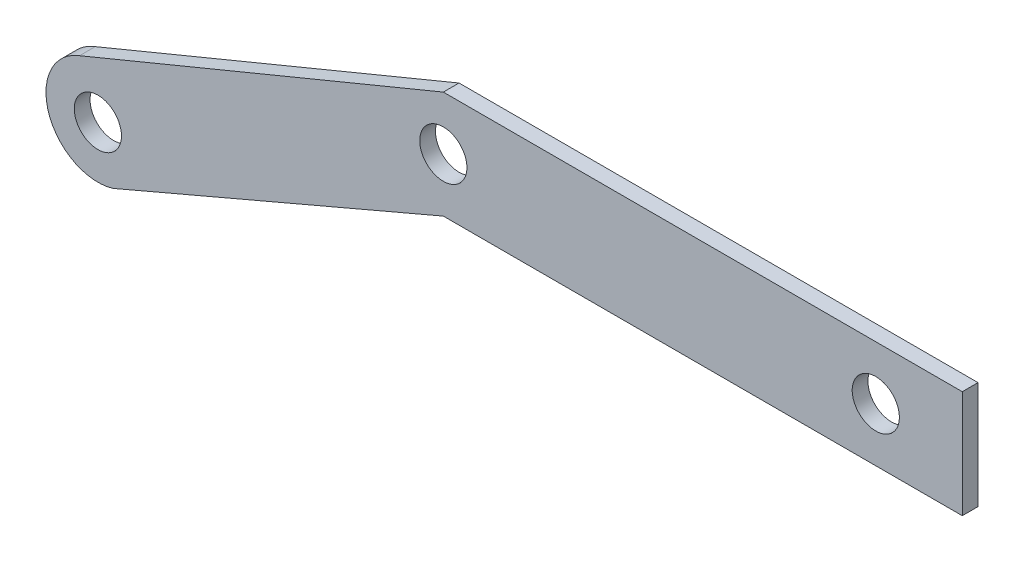
ISO-10303-21;
HEADER;
FILE_DESCRIPTION(('STEP AP214'),'2;1');
FILE_NAME('part.step','',(''),(''),'','','');
FILE_SCHEMA(('AUTOMOTIVE_DESIGN { 1 0 10303 214 1 1 1 1 }'));
ENDSEC;
DATA;
#1=APPLICATION_CONTEXT('core data for automotive mechanical design processes');
#2=APPLICATION_PROTOCOL_DEFINITION('international standard','automotive_design',2000,#1);
#3=PRODUCT_CONTEXT('',#1,'mechanical');
#4=PRODUCT('Part','Part','',(#3));
#5=PRODUCT_RELATED_PRODUCT_CATEGORY('part','',(#4));
#6=PRODUCT_DEFINITION_FORMATION('','',#4);
#7=PRODUCT_DEFINITION_CONTEXT('part definition',#1,'design');
#8=PRODUCT_DEFINITION('design','',#6,#7);
#9=PRODUCT_DEFINITION_SHAPE('','',#8);
#10=(LENGTH_UNIT() NAMED_UNIT(*) SI_UNIT(.MILLI.,.METRE.));
#11=(NAMED_UNIT(*) PLANE_ANGLE_UNIT() SI_UNIT($,.RADIAN.));
#12=(NAMED_UNIT(*) SI_UNIT($,.STERADIAN.) SOLID_ANGLE_UNIT());
#13=UNCERTAINTY_MEASURE_WITH_UNIT(LENGTH_MEASURE(1.E-05),#10,'distance_accuracy_value','');
#14=(GEOMETRIC_REPRESENTATION_CONTEXT(3) GLOBAL_UNCERTAINTY_ASSIGNED_CONTEXT((#13)) GLOBAL_UNIT_ASSIGNED_CONTEXT((#10,
#11,#12)) REPRESENTATION_CONTEXT('',''));
#15=CARTESIAN_POINT('',(0.,0.,0.));
#16=DIRECTION('',(0.,0.,1.));
#17=DIRECTION('',(1.,0.,0.));
#18=AXIS2_PLACEMENT_3D('',#15,#16,#17);
#19=CARTESIAN_POINT('',(-15.705782080516,12.9503608385512,1.));
#20=DIRECTION('',(0.,0.,1.));
#21=DIRECTION('',(1.,0.,0.));
#22=AXIS2_PLACEMENT_3D('',#19,#20,#21);
#23=PLANE('',#22);
#24=CARTESIAN_POINT('',(6.26121791948399,22.1848608385512,1.));
#25=DIRECTION('',(0.,0.,1.));
#26=DIRECTION('',(1.,0.,0.));
#27=AXIS2_PLACEMENT_3D('',#24,#25,#26);
#28=CIRCLE('',#27,1.5);
#29=CARTESIAN_POINT('',(7.76121791948399,22.1848608385512,1.));
#30=VERTEX_POINT('',#29);
#31=EDGE_CURVE('E185',#30,#30,#28,.T.);
#32=ORIENTED_EDGE('',*,*,#31,.F.);
#33=EDGE_LOOP('',(#32));
#34=FACE_BOUND('',#33,.T.);
#35=DIRECTION('',(0.,1.,0.));
#36=VECTOR('',#35,1.);
#37=CARTESIAN_POINT('',(39.261217919484,25.6003608385512,1.));
#38=LINE('',#37,#36);
#39=CARTESIAN_POINT('',(39.261217919484,18.7693608385514,1.));
#40=VERTEX_POINT('',#39);
#41=CARTESIAN_POINT('',(39.261217919484,25.6003608385512,1.));
#42=VERTEX_POINT('',#41);
#43=EDGE_CURVE('E130',#40,#42,#38,.T.);
#44=ORIENTED_EDGE('',*,*,#43,.T.);
#45=DIRECTION('',(-1.,0.,0.));
#46=VECTOR('',#45,1.);
#47=CARTESIAN_POINT('',(6.26121791948399,25.6003608385513,1.));
#48=LINE('',#47,#46);
#49=CARTESIAN_POINT('',(6.26121791948399,25.6003608385513,1.));
#50=VERTEX_POINT('',#49);
#51=EDGE_CURVE('E88',#42,#50,#48,.T.);
#52=ORIENTED_EDGE('',*,*,#51,.T.);
#53=DIRECTION('',(-0.924149912006193,-0.382030025179888,0.));
#54=VECTOR('',#53,1.);
#55=CARTESIAN_POINT('',(-16.8722094768274,16.0373410991188,1.));
#56=LINE('',#55,#54);
#57=CARTESIAN_POINT('',(-16.8722094768274,16.0373410991188,1.));
#58=VERTEX_POINT('',#57);
#59=EDGE_CURVE('E101',#50,#58,#56,.T.);
#60=ORIENTED_EDGE('',*,*,#59,.T.);
#61=CARTESIAN_POINT('',(-15.705782080516,12.9503608385512,1.));
#62=DIRECTION('',(0.,0.,1.));
#63=DIRECTION('',(1.,0.,0.));
#64=AXIS2_PLACEMENT_3D('',#61,#62,#63);
#65=CIRCLE('',#64,3.29999999999999);
#66=CARTESIAN_POINT('',(-14.7395138788082,9.79499623800688,1.));
#67=VERTEX_POINT('',#66);
#68=EDGE_CURVE('E95',#58,#67,#65,.T.);
#69=ORIENTED_EDGE('',*,*,#68,.T.);
#70=DIRECTION('',(0.919555921015902,0.392959168520847,0.));
#71=VECTOR('',#70,1.);
#72=CARTESIAN_POINT('',(6.26121791948399,18.7693608385514,1.));
#73=LINE('',#72,#71);
#74=CARTESIAN_POINT('',(6.26121791948399,18.7693608385514,1.));
#75=VERTEX_POINT('',#74);
#76=EDGE_CURVE('E99',#67,#75,#73,.T.);
#77=ORIENTED_EDGE('',*,*,#76,.T.);
#78=DIRECTION('',(1.,0.,0.));
#79=VECTOR('',#78,1.);
#80=CARTESIAN_POINT('',(6.26121791948399,18.7693608385514,1.));
#81=LINE('',#80,#79);
#82=EDGE_CURVE('E51',#75,#40,#81,.T.);
#83=ORIENTED_EDGE('',*,*,#82,.T.);
#84=EDGE_LOOP('',(#44,#52,#60,#69,#77,#83));
#85=FACE_BOUND('',#84,.T.);
#86=CARTESIAN_POINT('',(33.7612179194839,22.1848608385512,1.));
#87=DIRECTION('',(0.,0.,1.));
#88=DIRECTION('',(1.,0.,0.));
#89=AXIS2_PLACEMENT_3D('',#86,#87,#88);
#90=CIRCLE('',#89,1.5);
#91=CARTESIAN_POINT('',(35.261217919484,22.1848608385512,1.));
#92=VERTEX_POINT('',#91);
#93=EDGE_CURVE('E123',#92,#92,#90,.T.);
#94=ORIENTED_EDGE('',*,*,#93,.F.);
#95=EDGE_LOOP('',(#94));
#96=FACE_BOUND('',#95,.T.);
#97=CARTESIAN_POINT('',(-15.705782080516,12.9503608385512,1.));
#98=DIRECTION('',(0.,0.,1.));
#99=DIRECTION('',(1.,0.,0.));
#100=AXIS2_PLACEMENT_3D('',#97,#98,#99);
#101=CIRCLE('',#100,1.5);
#102=CARTESIAN_POINT('',(-14.205782080516,12.9503608385512,1.));
#103=VERTEX_POINT('',#102);
#104=EDGE_CURVE('E176',#103,#103,#101,.T.);
#105=ORIENTED_EDGE('',*,*,#104,.F.);
#106=EDGE_LOOP('',(#105));
#107=FACE_BOUND('',#106,.T.);
#108=ADVANCED_FACE('F34',(#34,#85,#96,#107),#23,.T.);
#109=CARTESIAN_POINT('',(-15.705782080516,12.9503608385512,0.));
#110=DIRECTION('',(0.,0.,1.));
#111=DIRECTION('',(1.,0.,0.));
#112=AXIS2_PLACEMENT_3D('',#109,#110,#111);
#113=PLANE('',#112);
#114=DIRECTION('',(0.,1.,0.));
#115=VECTOR('',#114,1.);
#116=CARTESIAN_POINT('',(39.261217919484,25.6003608385512,0.));
#117=LINE('',#116,#115);
#118=CARTESIAN_POINT('',(39.261217919484,18.7693608385514,0.));
#119=VERTEX_POINT('',#118);
#120=CARTESIAN_POINT('',(39.261217919484,25.6003608385512,0.));
#121=VERTEX_POINT('',#120);
#122=EDGE_CURVE('E119',#119,#121,#117,.T.);
#123=ORIENTED_EDGE('',*,*,#122,.F.);
#124=DIRECTION('',(1.,0.,0.));
#125=VECTOR('',#124,1.);
#126=CARTESIAN_POINT('',(6.26121791948399,18.7693608385514,0.));
#127=LINE('',#126,#125);
#128=CARTESIAN_POINT('',(6.26121791948399,18.7693608385514,0.));
#129=VERTEX_POINT('',#128);
#130=EDGE_CURVE('E80',#129,#119,#127,.T.);
#131=ORIENTED_EDGE('',*,*,#130,.F.);
#132=DIRECTION('',(0.919555921015902,0.392959168520847,0.));
#133=VECTOR('',#132,1.);
#134=CARTESIAN_POINT('',(6.26121791948399,18.7693608385514,0.));
#135=LINE('',#134,#133);
#136=CARTESIAN_POINT('',(-14.7395138788082,9.79499623800688,0.));
#137=VERTEX_POINT('',#136);
#138=EDGE_CURVE('E74',#137,#129,#135,.T.);
#139=ORIENTED_EDGE('',*,*,#138,.F.);
#140=CARTESIAN_POINT('',(-15.705782080516,12.9503608385512,0.));
#141=DIRECTION('',(0.,0.,1.));
#142=DIRECTION('',(1.,0.,0.));
#143=AXIS2_PLACEMENT_3D('',#140,#141,#142);
#144=CIRCLE('',#143,3.29999999999999);
#145=CARTESIAN_POINT('',(-16.8722094768274,16.0373410991188,0.));
#146=VERTEX_POINT('',#145);
#147=EDGE_CURVE('E109',#146,#137,#144,.T.);
#148=ORIENTED_EDGE('',*,*,#147,.F.);
#149=DIRECTION('',(-0.924149912006193,-0.382030025179888,0.));
#150=VECTOR('',#149,1.);
#151=CARTESIAN_POINT('',(-16.8722094768274,16.0373410991188,0.));
#152=LINE('',#151,#150);
#153=CARTESIAN_POINT('',(6.26121791948399,25.6003608385513,0.));
#154=VERTEX_POINT('',#153);
#155=EDGE_CURVE('E125',#154,#146,#152,.T.);
#156=ORIENTED_EDGE('',*,*,#155,.F.);
#157=DIRECTION('',(-1.,0.,0.));
#158=VECTOR('',#157,1.);
#159=CARTESIAN_POINT('',(6.26121791948399,25.6003608385513,0.));
#160=LINE('',#159,#158);
#161=EDGE_CURVE('E122',#121,#154,#160,.T.);
#162=ORIENTED_EDGE('',*,*,#161,.F.);
#163=EDGE_LOOP('',(#123,#131,#139,#148,#156,#162));
#164=FACE_BOUND('',#163,.T.);
#165=CARTESIAN_POINT('',(33.7612179194839,22.1848608385512,0.));
#166=DIRECTION('',(0.,0.,1.));
#167=DIRECTION('',(1.,0.,0.));
#168=AXIS2_PLACEMENT_3D('',#165,#166,#167);
#169=CIRCLE('',#168,1.5);
#170=CARTESIAN_POINT('',(35.261217919484,22.1848608385512,0.));
#171=VERTEX_POINT('',#170);
#172=EDGE_CURVE('E188',#171,#171,#169,.T.);
#173=ORIENTED_EDGE('',*,*,#172,.T.);
#174=EDGE_LOOP('',(#173));
#175=FACE_BOUND('',#174,.T.);
#176=CARTESIAN_POINT('',(6.26121791948399,22.1848608385512,0.));
#177=DIRECTION('',(0.,0.,1.));
#178=DIRECTION('',(1.,0.,0.));
#179=AXIS2_PLACEMENT_3D('',#176,#177,#178);
#180=CIRCLE('',#179,1.5);
#181=CARTESIAN_POINT('',(7.76121791948399,22.1848608385512,0.));
#182=VERTEX_POINT('',#181);
#183=EDGE_CURVE('E182',#182,#182,#180,.T.);
#184=ORIENTED_EDGE('',*,*,#183,.T.);
#185=EDGE_LOOP('',(#184));
#186=FACE_BOUND('',#185,.T.);
#187=CARTESIAN_POINT('',(-15.705782080516,12.9503608385512,0.));
#188=DIRECTION('',(0.,0.,1.));
#189=DIRECTION('',(1.,0.,0.));
#190=AXIS2_PLACEMENT_3D('',#187,#188,#189);
#191=CIRCLE('',#190,1.5);
#192=CARTESIAN_POINT('',(-14.205782080516,12.9503608385512,0.));
#193=VERTEX_POINT('',#192);
#194=EDGE_CURVE('E179',#193,#193,#191,.T.);
#195=ORIENTED_EDGE('',*,*,#194,.T.);
#196=EDGE_LOOP('',(#195));
#197=FACE_BOUND('',#196,.T.);
#198=ADVANCED_FACE('F139',(#164,#175,#186,#197),#113,.F.);
#199=CARTESIAN_POINT('',(39.261217919484,25.6003608385512,1.));
#200=DIRECTION('',(-1.,0.,0.));
#201=DIRECTION('',(0.,0.,1.));
#202=AXIS2_PLACEMENT_3D('',#199,#200,#201);
#203=PLANE('',#202);
#204=ORIENTED_EDGE('',*,*,#122,.T.);
#205=DIRECTION('',(0.,0.,-1.));
#206=VECTOR('',#205,1.);
#207=CARTESIAN_POINT('',(39.261217919484,25.6003608385512,1.));
#208=LINE('',#207,#206);
#209=EDGE_CURVE('E11',#42,#121,#208,.T.);
#210=ORIENTED_EDGE('',*,*,#209,.F.);
#211=ORIENTED_EDGE('',*,*,#43,.F.);
#212=DIRECTION('',(0.,0.,-1.));
#213=VECTOR('',#212,1.);
#214=CARTESIAN_POINT('',(39.261217919484,18.7693608385514,1.));
#215=LINE('',#214,#213);
#216=EDGE_CURVE('E115',#40,#119,#215,.T.);
#217=ORIENTED_EDGE('',*,*,#216,.T.);
#218=EDGE_LOOP('',(#204,#210,#211,#217));
#219=FACE_BOUND('',#218,.T.);
#220=ADVANCED_FACE('F36',(#219),#203,.F.);
#221=CARTESIAN_POINT('',(6.26121791948399,25.6003608385513,1.));
#222=DIRECTION('',(0.,-1.,0.));
#223=DIRECTION('',(1.,0.,0.));
#224=AXIS2_PLACEMENT_3D('',#221,#222,#223);
#225=PLANE('',#224);
#226=ORIENTED_EDGE('',*,*,#161,.T.);
#227=DIRECTION('',(0.,0.,-1.));
#228=VECTOR('',#227,1.);
#229=CARTESIAN_POINT('',(6.26121791948399,25.6003608385513,1.));
#230=LINE('',#229,#228);
#231=EDGE_CURVE('E43',#50,#154,#230,.T.);
#232=ORIENTED_EDGE('',*,*,#231,.F.);
#233=ORIENTED_EDGE('',*,*,#51,.F.);
#234=ORIENTED_EDGE('',*,*,#209,.T.);
#235=EDGE_LOOP('',(#226,#232,#233,#234));
#236=FACE_BOUND('',#235,.T.);
#237=ADVANCED_FACE('F238',(#236),#225,.F.);
#238=CARTESIAN_POINT('',(-16.8722094768274,16.0373410991188,1.));
#239=DIRECTION('',(0.382030025179888,-0.924149912006193,0.));
#240=DIRECTION('',(0.924149912006193,0.382030025179888,0.));
#241=AXIS2_PLACEMENT_3D('',#238,#239,#240);
#242=PLANE('',#241);
#243=ORIENTED_EDGE('',*,*,#155,.T.);
#244=DIRECTION('',(0.,0.,-1.));
#245=VECTOR('',#244,1.);
#246=CARTESIAN_POINT('',(-16.8722094768274,16.0373410991188,1.));
#247=LINE('',#246,#245);
#248=EDGE_CURVE('E110',#58,#146,#247,.T.);
#249=ORIENTED_EDGE('',*,*,#248,.F.);
#250=ORIENTED_EDGE('',*,*,#59,.F.);
#251=ORIENTED_EDGE('',*,*,#231,.T.);
#252=EDGE_LOOP('',(#243,#249,#250,#251));
#253=FACE_BOUND('',#252,.T.);
#254=ADVANCED_FACE('F136',(#253),#242,.F.);
#255=CARTESIAN_POINT('',(-15.705782080516,12.9503608385512,1.));
#256=DIRECTION('',(0.,0.,-1.));
#257=DIRECTION('',(-1.,0.,0.));
#258=AXIS2_PLACEMENT_3D('',#255,#256,#257);
#259=CYLINDRICAL_SURFACE('',#258,3.29999999999999);
#260=ORIENTED_EDGE('',*,*,#147,.T.);
#261=DIRECTION('',(0.,0.,-1.));
#262=VECTOR('',#261,1.);
#263=CARTESIAN_POINT('',(-14.7395138788082,9.79499623800688,1.));
#264=LINE('',#263,#262);
#265=EDGE_CURVE('E106',#67,#137,#264,.T.);
#266=ORIENTED_EDGE('',*,*,#265,.F.);
#267=ORIENTED_EDGE('',*,*,#68,.F.);
#268=ORIENTED_EDGE('',*,*,#248,.T.);
#269=EDGE_LOOP('',(#260,#266,#267,#268));
#270=FACE_BOUND('',#269,.T.);
#271=ADVANCED_FACE('F107',(#270),#259,.T.);
#272=CARTESIAN_POINT('',(6.26121791948399,18.7693608385514,1.));
#273=DIRECTION('',(-0.392959168520847,0.919555921015902,0.));
#274=DIRECTION('',(-0.919555921015902,-0.392959168520847,0.));
#275=AXIS2_PLACEMENT_3D('',#272,#273,#274);
#276=PLANE('',#275);
#277=ORIENTED_EDGE('',*,*,#138,.T.);
#278=DIRECTION('',(0.,0.,-1.));
#279=VECTOR('',#278,1.);
#280=CARTESIAN_POINT('',(6.26121791948399,18.7693608385514,1.));
#281=LINE('',#280,#279);
#282=EDGE_CURVE('E111',#75,#129,#281,.T.);
#283=ORIENTED_EDGE('',*,*,#282,.F.);
#284=ORIENTED_EDGE('',*,*,#76,.F.);
#285=ORIENTED_EDGE('',*,*,#265,.T.);
#286=EDGE_LOOP('',(#277,#283,#284,#285));
#287=FACE_BOUND('',#286,.T.);
#288=ADVANCED_FACE('F113',(#287),#276,.F.);
#289=CARTESIAN_POINT('',(6.26121791948399,18.7693608385514,1.));
#290=DIRECTION('',(0.,1.,0.));
#291=DIRECTION('',(0.,0.,1.));
#292=AXIS2_PLACEMENT_3D('',#289,#290,#291);
#293=PLANE('',#292);
#294=ORIENTED_EDGE('',*,*,#130,.T.);
#295=ORIENTED_EDGE('',*,*,#216,.F.);
#296=ORIENTED_EDGE('',*,*,#82,.F.);
#297=ORIENTED_EDGE('',*,*,#282,.T.);
#298=EDGE_LOOP('',(#294,#295,#296,#297));
#299=FACE_BOUND('',#298,.T.);
#300=ADVANCED_FACE('F144',(#299),#293,.F.);
#301=CARTESIAN_POINT('',(33.7612179194839,22.1848608385512,1.));
#302=DIRECTION('',(0.,0.,-1.));
#303=DIRECTION('',(-1.,0.,0.));
#304=AXIS2_PLACEMENT_3D('',#301,#302,#303);
#305=CYLINDRICAL_SURFACE('',#304,1.5);
#306=ORIENTED_EDGE('',*,*,#93,.T.);
#307=EDGE_LOOP('',(#306));
#308=FACE_BOUND('',#307,.T.);
#309=ORIENTED_EDGE('',*,*,#172,.F.);
#310=EDGE_LOOP('',(#309));
#311=FACE_BOUND('',#310,.T.);
#312=ADVANCED_FACE('F146',(#308,#311),#305,.F.);
#313=CARTESIAN_POINT('',(6.26121791948399,22.1848608385512,1.));
#314=DIRECTION('',(0.,0.,-1.));
#315=DIRECTION('',(-1.,0.,0.));
#316=AXIS2_PLACEMENT_3D('',#313,#314,#315);
#317=CYLINDRICAL_SURFACE('',#316,1.5);
#318=ORIENTED_EDGE('',*,*,#31,.T.);
#319=EDGE_LOOP('',(#318));
#320=FACE_BOUND('',#319,.T.);
#321=ORIENTED_EDGE('',*,*,#183,.F.);
#322=EDGE_LOOP('',(#321));
#323=FACE_BOUND('',#322,.T.);
#324=ADVANCED_FACE('F152',(#320,#323),#317,.F.);
#325=CARTESIAN_POINT('',(-15.705782080516,12.9503608385512,1.));
#326=DIRECTION('',(0.,0.,-1.));
#327=DIRECTION('',(-1.,0.,0.));
#328=AXIS2_PLACEMENT_3D('',#325,#326,#327);
#329=CYLINDRICAL_SURFACE('',#328,1.5);
#330=ORIENTED_EDGE('',*,*,#104,.T.);
#331=EDGE_LOOP('',(#330));
#332=FACE_BOUND('',#331,.T.);
#333=ORIENTED_EDGE('',*,*,#194,.F.);
#334=EDGE_LOOP('',(#333));
#335=FACE_BOUND('',#334,.T.);
#336=ADVANCED_FACE('F167',(#332,#335),#329,.F.);
#337=CLOSED_SHELL('',(#108,#198,#220,#237,#254,#271,#288,#300,#312,#324,#336));
#338=MANIFOLD_SOLID_BREP('B2',#337);
#339=ADVANCED_BREP_SHAPE_REPRESENTATION('',(#18,#338),#14);
#340=SHAPE_DEFINITION_REPRESENTATION(#9,#339);
ENDSEC;
END-ISO-10303-21;
